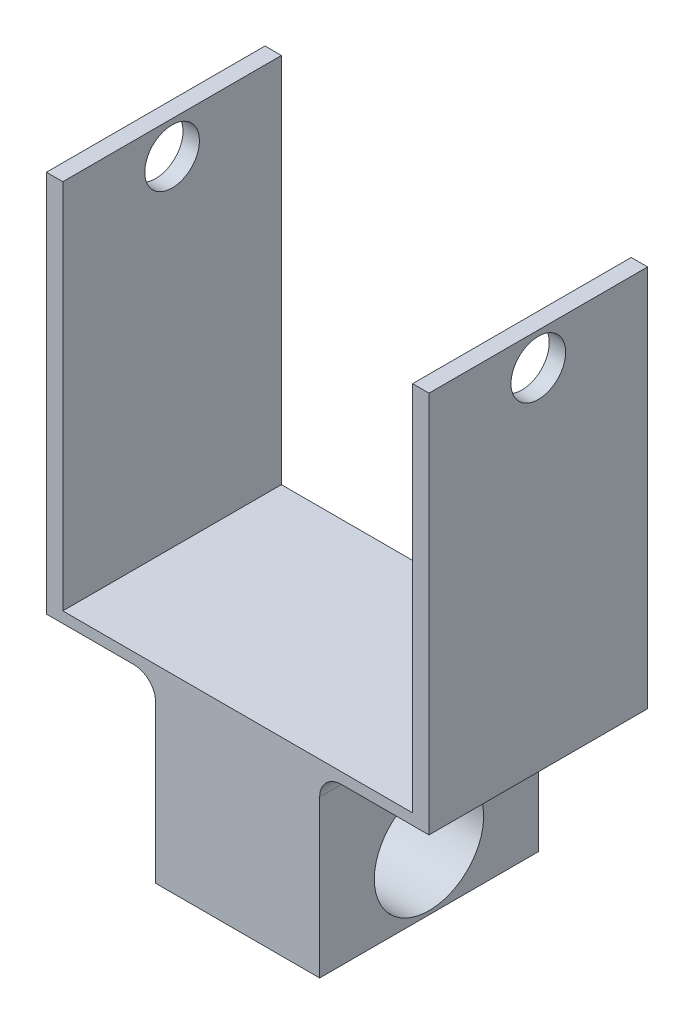
ISO-10303-21;
HEADER;
FILE_DESCRIPTION(('STEP AP214'),'2;1');
FILE_NAME('part.step','',(''),(''),'','','');
FILE_SCHEMA(('AUTOMOTIVE_DESIGN { 1 0 10303 214 1 1 1 1 }'));
ENDSEC;
DATA;
#1=APPLICATION_CONTEXT('core data for automotive mechanical design processes');
#2=APPLICATION_PROTOCOL_DEFINITION('international standard','automotive_design',2000,#1);
#3=PRODUCT_CONTEXT('',#1,'mechanical');
#4=PRODUCT('Part','Part','',(#3));
#5=PRODUCT_RELATED_PRODUCT_CATEGORY('part','',(#4));
#6=PRODUCT_DEFINITION_FORMATION('','',#4);
#7=PRODUCT_DEFINITION_CONTEXT('part definition',#1,'design');
#8=PRODUCT_DEFINITION('design','',#6,#7);
#9=PRODUCT_DEFINITION_SHAPE('','',#8);
#10=(LENGTH_UNIT() NAMED_UNIT(*) SI_UNIT(.MILLI.,.METRE.));
#11=(NAMED_UNIT(*) PLANE_ANGLE_UNIT() SI_UNIT($,.RADIAN.));
#12=(NAMED_UNIT(*) SI_UNIT($,.STERADIAN.) SOLID_ANGLE_UNIT());
#13=UNCERTAINTY_MEASURE_WITH_UNIT(LENGTH_MEASURE(1.E-05),#10,'distance_accuracy_value','');
#14=(GEOMETRIC_REPRESENTATION_CONTEXT(3) GLOBAL_UNCERTAINTY_ASSIGNED_CONTEXT((#13)) GLOBAL_UNIT_ASSIGNED_CONTEXT((#10,
#11,#12)) REPRESENTATION_CONTEXT('',''));
#15=CARTESIAN_POINT('',(0.,0.,0.));
#16=DIRECTION('',(0.,0.,1.));
#17=DIRECTION('',(1.,0.,0.));
#18=AXIS2_PLACEMENT_3D('',#15,#16,#17);
#19=CARTESIAN_POINT('',(-17.5,40.,0.));
#20=DIRECTION('',(0.,0.,-1.));
#21=DIRECTION('',(-1.,0.,0.));
#22=AXIS2_PLACEMENT_3D('',#19,#20,#21);
#23=PLANE('',#22);
#24=DIRECTION('',(1.,0.,0.));
#25=VECTOR('',#24,1.);
#26=CARTESIAN_POINT('',(-17.5,-11.3317768302769,0.));
#27=LINE('',#26,#25);
#28=CARTESIAN_POINT('',(-7.5,-11.3317768302769,0.));
#29=VERTEX_POINT('',#28);
#30=CARTESIAN_POINT('',(7.5,-11.3317768302769,0.));
#31=VERTEX_POINT('',#30);
#32=EDGE_CURVE('E47',#29,#31,#27,.T.);
#33=ORIENTED_EDGE('',*,*,#32,.T.);
#34=DIRECTION('',(0.,1.,0.));
#35=VECTOR('',#34,1.);
#36=CARTESIAN_POINT('',(7.5,-16.,0.));
#37=LINE('',#36,#35);
#38=CARTESIAN_POINT('',(7.5,3.,0.));
#39=VERTEX_POINT('',#38);
#40=EDGE_CURVE('E149',#31,#39,#37,.T.);
#41=ORIENTED_EDGE('',*,*,#40,.T.);
#42=CARTESIAN_POINT('',(9.5,3.,0.));
#43=DIRECTION('',(0.,0.,-1.));
#44=DIRECTION('',(-1.,0.,0.));
#45=AXIS2_PLACEMENT_3D('',#42,#43,#44);
#46=CIRCLE('',#45,2.);
#47=CARTESIAN_POINT('',(9.5,5.,0.));
#48=VERTEX_POINT('',#47);
#49=EDGE_CURVE('E41',#39,#48,#46,.T.);
#50=ORIENTED_EDGE('',*,*,#49,.T.);
#51=DIRECTION('',(1.,0.,0.));
#52=VECTOR('',#51,1.);
#53=CARTESIAN_POINT('',(17.5,5.,0.));
#54=LINE('',#53,#52);
#55=CARTESIAN_POINT('',(17.5,5.,0.));
#56=VERTEX_POINT('',#55);
#57=EDGE_CURVE('E204',#48,#56,#54,.T.);
#58=ORIENTED_EDGE('',*,*,#57,.T.);
#59=DIRECTION('',(0.,-1.,0.));
#60=VECTOR('',#59,1.);
#61=CARTESIAN_POINT('',(17.5,40.,0.));
#62=LINE('',#61,#60);
#63=CARTESIAN_POINT('',(17.5,40.,0.));
#64=VERTEX_POINT('',#63);
#65=EDGE_CURVE('E175',#64,#56,#62,.T.);
#66=ORIENTED_EDGE('',*,*,#65,.F.);
#67=DIRECTION('',(1.,0.,0.));
#68=VECTOR('',#67,1.);
#69=CARTESIAN_POINT('',(-17.5,40.,0.));
#70=LINE('',#69,#68);
#71=CARTESIAN_POINT('',(16.,40.,0.));
#72=VERTEX_POINT('',#71);
#73=EDGE_CURVE('E159',#72,#64,#70,.T.);
#74=ORIENTED_EDGE('',*,*,#73,.F.);
#75=DIRECTION('',(0.,1.,0.));
#76=VECTOR('',#75,1.);
#77=CARTESIAN_POINT('',(16.,40.,0.));
#78=LINE('',#77,#76);
#79=CARTESIAN_POINT('',(16.,6.00000000000001,0.));
#80=VERTEX_POINT('',#79);
#81=EDGE_CURVE('E244',#80,#72,#78,.T.);
#82=ORIENTED_EDGE('',*,*,#81,.F.);
#83=DIRECTION('',(1.,0.,0.));
#84=VECTOR('',#83,1.);
#85=CARTESIAN_POINT('',(-16.,6.,0.));
#86=LINE('',#85,#84);
#87=CARTESIAN_POINT('',(-16.,6.,0.));
#88=VERTEX_POINT('',#87);
#89=EDGE_CURVE('E253',#88,#80,#86,.T.);
#90=ORIENTED_EDGE('',*,*,#89,.F.);
#91=DIRECTION('',(0.,-1.,0.));
#92=VECTOR('',#91,1.);
#93=CARTESIAN_POINT('',(-16.,40.,0.));
#94=LINE('',#93,#92);
#95=CARTESIAN_POINT('',(-16.,40.,0.));
#96=VERTEX_POINT('',#95);
#97=EDGE_CURVE('E239',#96,#88,#94,.T.);
#98=ORIENTED_EDGE('',*,*,#97,.F.);
#99=CARTESIAN_POINT('',(-17.5,40.,0.));
#100=VERTEX_POINT('',#99);
#101=EDGE_CURVE('E160',#100,#96,#70,.T.);
#102=ORIENTED_EDGE('',*,*,#101,.F.);
#103=DIRECTION('',(0.,-1.,0.));
#104=VECTOR('',#103,1.);
#105=CARTESIAN_POINT('',(-17.5,40.,0.));
#106=LINE('',#105,#104);
#107=CARTESIAN_POINT('',(-17.5,5.,0.));
#108=VERTEX_POINT('',#107);
#109=EDGE_CURVE('E178',#100,#108,#106,.T.);
#110=ORIENTED_EDGE('',*,*,#109,.T.);
#111=DIRECTION('',(1.,0.,0.));
#112=VECTOR('',#111,1.);
#113=CARTESIAN_POINT('',(-17.5,5.,0.));
#114=LINE('',#113,#112);
#115=CARTESIAN_POINT('',(-9.5,5.,0.));
#116=VERTEX_POINT('',#115);
#117=EDGE_CURVE('E221',#108,#116,#114,.T.);
#118=ORIENTED_EDGE('',*,*,#117,.T.);
#119=CARTESIAN_POINT('',(-9.5,3.,0.));
#120=DIRECTION('',(0.,0.,-1.));
#121=DIRECTION('',(-1.,0.,0.));
#122=AXIS2_PLACEMENT_3D('',#119,#120,#121);
#123=CIRCLE('',#122,2.);
#124=CARTESIAN_POINT('',(-7.5,3.,0.));
#125=VERTEX_POINT('',#124);
#126=EDGE_CURVE('E196',#116,#125,#123,.T.);
#127=ORIENTED_EDGE('',*,*,#126,.T.);
#128=DIRECTION('',(0.,1.,0.));
#129=VECTOR('',#128,1.);
#130=CARTESIAN_POINT('',(-7.5,-16.,0.));
#131=LINE('',#130,#129);
#132=EDGE_CURVE('E147',#29,#125,#131,.T.);
#133=ORIENTED_EDGE('',*,*,#132,.F.);
#134=EDGE_LOOP('',(#33,#41,#50,#58,#66,#74,#82,#90,#98,#102,#110,#118,#127,#133));
#135=FACE_BOUND('',#134,.T.);
#136=ADVANCED_FACE('F33',(#135),#23,.F.);
#137=CARTESIAN_POINT('',(-17.5,40.,-20.));
#138=DIRECTION('',(0.,0.,1.));
#139=DIRECTION('',(1.,0.,0.));
#140=AXIS2_PLACEMENT_3D('',#137,#138,#139);
#141=PLANE('',#140);
#142=DIRECTION('',(1.,0.,0.));
#143=VECTOR('',#142,1.);
#144=CARTESIAN_POINT('',(-17.5,-11.3317768302769,-20.));
#145=LINE('',#144,#143);
#146=CARTESIAN_POINT('',(-7.5,-11.3317768302769,-20.));
#147=VERTEX_POINT('',#146);
#148=CARTESIAN_POINT('',(7.5,-11.3317768302769,-20.));
#149=VERTEX_POINT('',#148);
#150=EDGE_CURVE('E134',#147,#149,#145,.T.);
#151=ORIENTED_EDGE('',*,*,#150,.F.);
#152=DIRECTION('',(0.,1.,0.));
#153=VECTOR('',#152,1.);
#154=CARTESIAN_POINT('',(-7.5,-16.,-20.));
#155=LINE('',#154,#153);
#156=CARTESIAN_POINT('',(-7.5,3.,-20.));
#157=VERTEX_POINT('',#156);
#158=EDGE_CURVE('E140',#147,#157,#155,.T.);
#159=ORIENTED_EDGE('',*,*,#158,.T.);
#160=CARTESIAN_POINT('',(-9.5,3.,-20.));
#161=DIRECTION('',(0.,0.,1.));
#162=DIRECTION('',(1.,0.,0.));
#163=AXIS2_PLACEMENT_3D('',#160,#161,#162);
#164=CIRCLE('',#163,2.);
#165=CARTESIAN_POINT('',(-9.5,5.,-20.));
#166=VERTEX_POINT('',#165);
#167=EDGE_CURVE('E194',#157,#166,#164,.T.);
#168=ORIENTED_EDGE('',*,*,#167,.T.);
#169=DIRECTION('',(1.,0.,0.));
#170=VECTOR('',#169,1.);
#171=CARTESIAN_POINT('',(-17.5,5.,-20.));
#172=LINE('',#171,#170);
#173=CARTESIAN_POINT('',(-17.5,5.,-20.));
#174=VERTEX_POINT('',#173);
#175=EDGE_CURVE('E229',#174,#166,#172,.T.);
#176=ORIENTED_EDGE('',*,*,#175,.F.);
#177=DIRECTION('',(0.,-1.,0.));
#178=VECTOR('',#177,1.);
#179=CARTESIAN_POINT('',(-17.5,40.,-20.));
#180=LINE('',#179,#178);
#181=CARTESIAN_POINT('',(-17.5,40.,-20.));
#182=VERTEX_POINT('',#181);
#183=EDGE_CURVE('E169',#182,#174,#180,.T.);
#184=ORIENTED_EDGE('',*,*,#183,.F.);
#185=DIRECTION('',(-1.,0.,0.));
#186=VECTOR('',#185,1.);
#187=CARTESIAN_POINT('',(-17.5,40.,-20.));
#188=LINE('',#187,#186);
#189=CARTESIAN_POINT('',(-16.,40.,-20.));
#190=VERTEX_POINT('',#189);
#191=EDGE_CURVE('E165',#190,#182,#188,.T.);
#192=ORIENTED_EDGE('',*,*,#191,.F.);
#193=DIRECTION('',(0.,-1.,0.));
#194=VECTOR('',#193,1.);
#195=CARTESIAN_POINT('',(-16.,40.,-20.));
#196=LINE('',#195,#194);
#197=CARTESIAN_POINT('',(-16.,6.,-20.));
#198=VERTEX_POINT('',#197);
#199=EDGE_CURVE('E240',#190,#198,#196,.T.);
#200=ORIENTED_EDGE('',*,*,#199,.T.);
#201=DIRECTION('',(1.,0.,0.));
#202=VECTOR('',#201,1.);
#203=CARTESIAN_POINT('',(-16.,6.,-20.));
#204=LINE('',#203,#202);
#205=CARTESIAN_POINT('',(16.,6.00000000000001,-20.));
#206=VERTEX_POINT('',#205);
#207=EDGE_CURVE('E243',#198,#206,#204,.T.);
#208=ORIENTED_EDGE('',*,*,#207,.T.);
#209=DIRECTION('',(0.,1.,0.));
#210=VECTOR('',#209,1.);
#211=CARTESIAN_POINT('',(16.,40.,-20.));
#212=LINE('',#211,#210);
#213=CARTESIAN_POINT('',(16.,40.,-20.));
#214=VERTEX_POINT('',#213);
#215=EDGE_CURVE('E247',#206,#214,#212,.T.);
#216=ORIENTED_EDGE('',*,*,#215,.T.);
#217=CARTESIAN_POINT('',(17.5,40.,-20.));
#218=VERTEX_POINT('',#217);
#219=EDGE_CURVE('E166',#218,#214,#188,.T.);
#220=ORIENTED_EDGE('',*,*,#219,.F.);
#221=DIRECTION('',(0.,-1.,0.));
#222=VECTOR('',#221,1.);
#223=CARTESIAN_POINT('',(17.5,40.,-20.));
#224=LINE('',#223,#222);
#225=CARTESIAN_POINT('',(17.5,5.,-20.));
#226=VERTEX_POINT('',#225);
#227=EDGE_CURVE('E172',#218,#226,#224,.T.);
#228=ORIENTED_EDGE('',*,*,#227,.T.);
#229=DIRECTION('',(1.,0.,0.));
#230=VECTOR('',#229,1.);
#231=CARTESIAN_POINT('',(17.5,5.,-20.));
#232=LINE('',#231,#230);
#233=CARTESIAN_POINT('',(9.5,5.,-20.));
#234=VERTEX_POINT('',#233);
#235=EDGE_CURVE('E215',#234,#226,#232,.T.);
#236=ORIENTED_EDGE('',*,*,#235,.F.);
#237=CARTESIAN_POINT('',(9.5,3.,-20.));
#238=DIRECTION('',(0.,0.,1.));
#239=DIRECTION('',(1.,0.,0.));
#240=AXIS2_PLACEMENT_3D('',#237,#238,#239);
#241=CIRCLE('',#240,2.);
#242=CARTESIAN_POINT('',(7.5,3.,-20.));
#243=VERTEX_POINT('',#242);
#244=EDGE_CURVE('E199',#234,#243,#241,.T.);
#245=ORIENTED_EDGE('',*,*,#244,.T.);
#246=DIRECTION('',(0.,1.,0.));
#247=VECTOR('',#246,1.);
#248=CARTESIAN_POINT('',(7.5,-16.,-20.));
#249=LINE('',#248,#247);
#250=EDGE_CURVE('E55',#149,#243,#249,.T.);
#251=ORIENTED_EDGE('',*,*,#250,.F.);
#252=EDGE_LOOP('',(#151,#159,#168,#176,#184,#192,#200,#208,#216,#220,#228,#236,#245,#251));
#253=FACE_BOUND('',#252,.T.);
#254=ADVANCED_FACE('F139',(#253),#141,.F.);
#255=CARTESIAN_POINT('',(7.5,-16.,-20.));
#256=DIRECTION('',(-1.,0.,0.));
#257=DIRECTION('',(0.,0.,1.));
#258=AXIS2_PLACEMENT_3D('',#255,#256,#257);
#259=PLANE('',#258);
#260=CARTESIAN_POINT('',(7.5,-6.,-10.));
#261=DIRECTION('',(-1.,0.,0.));
#262=DIRECTION('',(0.,0.,1.));
#263=AXIS2_PLACEMENT_3D('',#260,#261,#262);
#264=CIRCLE('',#263,5.);
#265=CARTESIAN_POINT('',(7.5,-6.,-5.));
#266=VERTEX_POINT('',#265);
#267=EDGE_CURVE('E151',#266,#266,#264,.T.);
#268=ORIENTED_EDGE('',*,*,#267,.T.);
#269=EDGE_LOOP('',(#268));
#270=FACE_BOUND('',#269,.T.);
#271=DIRECTION('',(0.,0.,1.));
#272=VECTOR('',#271,1.);
#273=CARTESIAN_POINT('',(7.5,-11.3317768302769,-20.));
#274=LINE('',#273,#272);
#275=EDGE_CURVE('E231',#149,#31,#274,.T.);
#276=ORIENTED_EDGE('',*,*,#275,.F.);
#277=ORIENTED_EDGE('',*,*,#250,.T.);
#278=DIRECTION('',(0.,0.,-1.));
#279=VECTOR('',#278,1.);
#280=CARTESIAN_POINT('',(7.5,3.,0.));
#281=LINE('',#280,#279);
#282=EDGE_CURVE('E192',#243,#39,#281,.F.);
#283=ORIENTED_EDGE('',*,*,#282,.T.);
#284=ORIENTED_EDGE('',*,*,#40,.F.);
#285=EDGE_LOOP('',(#276,#277,#283,#284));
#286=FACE_BOUND('',#285,.T.);
#287=ADVANCED_FACE('F270',(#270,#286),#259,.F.);
#288=CARTESIAN_POINT('',(-7.5,-16.,-20.));
#289=DIRECTION('',(1.,0.,0.));
#290=DIRECTION('',(0.,0.,-1.));
#291=AXIS2_PLACEMENT_3D('',#288,#289,#290);
#292=PLANE('',#291);
#293=CARTESIAN_POINT('',(-7.5,-6.,-10.));
#294=DIRECTION('',(-1.,0.,0.));
#295=DIRECTION('',(0.,0.,1.));
#296=AXIS2_PLACEMENT_3D('',#293,#294,#295);
#297=CIRCLE('',#296,5.);
#298=CARTESIAN_POINT('',(-7.5,-6.,-5.));
#299=VERTEX_POINT('',#298);
#300=EDGE_CURVE('E259',#299,#299,#297,.T.);
#301=ORIENTED_EDGE('',*,*,#300,.F.);
#302=EDGE_LOOP('',(#301));
#303=FACE_BOUND('',#302,.T.);
#304=DIRECTION('',(0.,0.,-1.));
#305=VECTOR('',#304,1.);
#306=CARTESIAN_POINT('',(-7.5,-11.3317768302769,-20.));
#307=LINE('',#306,#305);
#308=EDGE_CURVE('E11',#29,#147,#307,.T.);
#309=ORIENTED_EDGE('',*,*,#308,.F.);
#310=ORIENTED_EDGE('',*,*,#132,.T.);
#311=DIRECTION('',(0.,0.,-1.));
#312=VECTOR('',#311,1.);
#313=CARTESIAN_POINT('',(-7.5,3.,-20.));
#314=LINE('',#313,#312);
#315=EDGE_CURVE('E146',#125,#157,#314,.T.);
#316=ORIENTED_EDGE('',*,*,#315,.T.);
#317=ORIENTED_EDGE('',*,*,#158,.F.);
#318=EDGE_LOOP('',(#309,#310,#316,#317));
#319=FACE_BOUND('',#318,.T.);
#320=ADVANCED_FACE('F144',(#303,#319),#292,.F.);
#321=CARTESIAN_POINT('',(0.,40.,0.));
#322=DIRECTION('',(0.,-1.,0.));
#323=DIRECTION('',(0.,0.,-1.));
#324=AXIS2_PLACEMENT_3D('',#321,#322,#323);
#325=PLANE('',#324);
#326=ORIENTED_EDGE('',*,*,#101,.T.);
#327=DIRECTION('',(0.,0.,1.));
#328=VECTOR('',#327,1.);
#329=CARTESIAN_POINT('',(-16.,40.,-20.));
#330=LINE('',#329,#328);
#331=EDGE_CURVE('E257',#190,#96,#330,.T.);
#332=ORIENTED_EDGE('',*,*,#331,.F.);
#333=ORIENTED_EDGE('',*,*,#191,.T.);
#334=DIRECTION('',(0.,0.,1.));
#335=VECTOR('',#334,1.);
#336=CARTESIAN_POINT('',(-17.5,40.,0.));
#337=LINE('',#336,#335);
#338=EDGE_CURVE('E156',#182,#100,#337,.T.);
#339=ORIENTED_EDGE('',*,*,#338,.T.);
#340=EDGE_LOOP('',(#326,#332,#333,#339));
#341=FACE_BOUND('',#340,.T.);
#342=ADVANCED_FACE('F288',(#341),#325,.F.);
#343=CARTESIAN_POINT('',(-17.5,40.,0.));
#344=DIRECTION('',(1.,0.,0.));
#345=DIRECTION('',(0.,0.,-1.));
#346=AXIS2_PLACEMENT_3D('',#343,#344,#345);
#347=PLANE('',#346);
#348=CARTESIAN_POINT('',(-17.5,37.,-10.));
#349=DIRECTION('',(-1.,0.,0.));
#350=DIRECTION('',(0.,0.,1.));
#351=AXIS2_PLACEMENT_3D('',#348,#349,#350);
#352=CIRCLE('',#351,2.5);
#353=CARTESIAN_POINT('',(-17.5,37.,-7.5));
#354=VERTEX_POINT('',#353);
#355=EDGE_CURVE('E226',#354,#354,#352,.T.);
#356=ORIENTED_EDGE('',*,*,#355,.F.);
#357=EDGE_LOOP('',(#356));
#358=FACE_BOUND('',#357,.T.);
#359=ORIENTED_EDGE('',*,*,#183,.T.);
#360=DIRECTION('',(0.,0.,-1.));
#361=VECTOR('',#360,1.);
#362=CARTESIAN_POINT('',(-17.5,5.,0.));
#363=LINE('',#362,#361);
#364=EDGE_CURVE('E219',#108,#174,#363,.T.);
#365=ORIENTED_EDGE('',*,*,#364,.F.);
#366=ORIENTED_EDGE('',*,*,#109,.F.);
#367=ORIENTED_EDGE('',*,*,#338,.F.);
#368=EDGE_LOOP('',(#359,#365,#366,#367));
#369=FACE_BOUND('',#368,.T.);
#370=ADVANCED_FACE('F298',(#358,#369),#347,.F.);
#371=CARTESIAN_POINT('',(17.5,40.,0.));
#372=DIRECTION('',(-1.,0.,0.));
#373=DIRECTION('',(0.,0.,1.));
#374=AXIS2_PLACEMENT_3D('',#371,#372,#373);
#375=PLANE('',#374);
#376=CARTESIAN_POINT('',(17.5,37.,-10.));
#377=DIRECTION('',(-1.,0.,0.));
#378=DIRECTION('',(0.,0.,1.));
#379=AXIS2_PLACEMENT_3D('',#376,#377,#378);
#380=CIRCLE('',#379,2.5);
#381=CARTESIAN_POINT('',(17.5,37.,-7.5));
#382=VERTEX_POINT('',#381);
#383=EDGE_CURVE('E185',#382,#382,#380,.T.);
#384=ORIENTED_EDGE('',*,*,#383,.T.);
#385=EDGE_LOOP('',(#384));
#386=FACE_BOUND('',#385,.T.);
#387=ORIENTED_EDGE('',*,*,#65,.T.);
#388=DIRECTION('',(0.,0.,-1.));
#389=VECTOR('',#388,1.);
#390=CARTESIAN_POINT('',(17.5,5.,0.));
#391=LINE('',#390,#389);
#392=EDGE_CURVE('E214',#56,#226,#391,.T.);
#393=ORIENTED_EDGE('',*,*,#392,.T.);
#394=ORIENTED_EDGE('',*,*,#227,.F.);
#395=DIRECTION('',(0.,0.,-1.));
#396=VECTOR('',#395,1.);
#397=CARTESIAN_POINT('',(17.5,40.,0.));
#398=LINE('',#397,#396);
#399=EDGE_CURVE('E163',#64,#218,#398,.T.);
#400=ORIENTED_EDGE('',*,*,#399,.F.);
#401=EDGE_LOOP('',(#387,#393,#394,#400));
#402=FACE_BOUND('',#401,.T.);
#403=ADVANCED_FACE('F285',(#386,#402),#375,.F.);
#404=ORIENTED_EDGE('',*,*,#219,.T.);
#405=DIRECTION('',(0.,0.,1.));
#406=VECTOR('',#405,1.);
#407=CARTESIAN_POINT('',(16.,40.,-20.));
#408=LINE('',#407,#406);
#409=EDGE_CURVE('E260',#214,#72,#408,.T.);
#410=ORIENTED_EDGE('',*,*,#409,.T.);
#411=ORIENTED_EDGE('',*,*,#73,.T.);
#412=ORIENTED_EDGE('',*,*,#399,.T.);
#413=EDGE_LOOP('',(#404,#410,#411,#412));
#414=FACE_BOUND('',#413,.T.);
#415=ADVANCED_FACE('F275',(#414),#325,.F.);
#416=CARTESIAN_POINT('',(17.5,-6.,-10.));
#417=DIRECTION('',(-1.,0.,0.));
#418=DIRECTION('',(0.,0.,1.));
#419=AXIS2_PLACEMENT_3D('',#416,#417,#418);
#420=CYLINDRICAL_SURFACE('',#419,5.);
#421=ORIENTED_EDGE('',*,*,#300,.T.);
#422=EDGE_LOOP('',(#421));
#423=FACE_BOUND('',#422,.T.);
#424=ORIENTED_EDGE('',*,*,#267,.F.);
#425=EDGE_LOOP('',(#424));
#426=FACE_BOUND('',#425,.T.);
#427=ADVANCED_FACE('F272',(#423,#426),#420,.F.);
#428=CARTESIAN_POINT('',(-16.,40.,-20.));
#429=DIRECTION('',(-1.,0.,0.));
#430=DIRECTION('',(0.,-1.,0.));
#431=AXIS2_PLACEMENT_3D('',#428,#429,#430);
#432=PLANE('',#431);
#433=CARTESIAN_POINT('',(-16.,37.,-10.));
#434=DIRECTION('',(-1.,0.,0.));
#435=DIRECTION('',(0.,-1.,0.));
#436=AXIS2_PLACEMENT_3D('',#433,#434,#435);
#437=CIRCLE('',#436,2.5);
#438=CARTESIAN_POINT('',(-16.,34.5,-10.));
#439=VERTEX_POINT('',#438);
#440=EDGE_CURVE('E184',#439,#439,#437,.T.);
#441=ORIENTED_EDGE('',*,*,#440,.T.);
#442=EDGE_LOOP('',(#441));
#443=FACE_BOUND('',#442,.T.);
#444=ORIENTED_EDGE('',*,*,#97,.T.);
#445=DIRECTION('',(0.,0.,1.));
#446=VECTOR('',#445,1.);
#447=CARTESIAN_POINT('',(-16.,6.,-20.));
#448=LINE('',#447,#446);
#449=EDGE_CURVE('E250',#198,#88,#448,.T.);
#450=ORIENTED_EDGE('',*,*,#449,.F.);
#451=ORIENTED_EDGE('',*,*,#199,.F.);
#452=ORIENTED_EDGE('',*,*,#331,.T.);
#453=EDGE_LOOP('',(#444,#450,#451,#452));
#454=FACE_BOUND('',#453,.T.);
#455=ADVANCED_FACE('F274',(#443,#454),#432,.F.);
#456=CARTESIAN_POINT('',(16.,40.,-20.));
#457=DIRECTION('',(1.,0.,0.));
#458=DIRECTION('',(0.,1.,0.));
#459=AXIS2_PLACEMENT_3D('',#456,#457,#458);
#460=PLANE('',#459);
#461=CARTESIAN_POINT('',(16.,37.,-10.));
#462=DIRECTION('',(1.,0.,0.));
#463=DIRECTION('',(0.,1.,0.));
#464=AXIS2_PLACEMENT_3D('',#461,#462,#463);
#465=CIRCLE('',#464,2.5);
#466=CARTESIAN_POINT('',(16.,39.5,-10.));
#467=VERTEX_POINT('',#466);
#468=EDGE_CURVE('E181',#467,#467,#465,.T.);
#469=ORIENTED_EDGE('',*,*,#468,.T.);
#470=EDGE_LOOP('',(#469));
#471=FACE_BOUND('',#470,.T.);
#472=ORIENTED_EDGE('',*,*,#81,.T.);
#473=ORIENTED_EDGE('',*,*,#409,.F.);
#474=ORIENTED_EDGE('',*,*,#215,.F.);
#475=DIRECTION('',(0.,0.,1.));
#476=VECTOR('',#475,1.);
#477=CARTESIAN_POINT('',(16.,6.00000000000001,-20.));
#478=LINE('',#477,#476);
#479=EDGE_CURVE('E263',#206,#80,#478,.T.);
#480=ORIENTED_EDGE('',*,*,#479,.T.);
#481=EDGE_LOOP('',(#472,#473,#474,#480));
#482=FACE_BOUND('',#481,.T.);
#483=ADVANCED_FACE('F282',(#471,#482),#460,.F.);
#484=CARTESIAN_POINT('',(-16.,6.,-20.));
#485=DIRECTION('',(0.,-1.,0.));
#486=DIRECTION('',(1.,0.,0.));
#487=AXIS2_PLACEMENT_3D('',#484,#485,#486);
#488=PLANE('',#487);
#489=ORIENTED_EDGE('',*,*,#89,.T.);
#490=ORIENTED_EDGE('',*,*,#479,.F.);
#491=ORIENTED_EDGE('',*,*,#207,.F.);
#492=ORIENTED_EDGE('',*,*,#449,.T.);
#493=EDGE_LOOP('',(#489,#490,#491,#492));
#494=FACE_BOUND('',#493,.T.);
#495=ADVANCED_FACE('F328',(#494),#488,.F.);
#496=CARTESIAN_POINT('',(17.5,37.,-10.));
#497=DIRECTION('',(-1.,0.,0.));
#498=DIRECTION('',(0.,0.,1.));
#499=AXIS2_PLACEMENT_3D('',#496,#497,#498);
#500=CYLINDRICAL_SURFACE('',#499,2.5);
#501=ORIENTED_EDGE('',*,*,#383,.F.);
#502=EDGE_LOOP('',(#501));
#503=FACE_BOUND('',#502,.T.);
#504=ORIENTED_EDGE('',*,*,#468,.F.);
#505=EDGE_LOOP('',(#504));
#506=FACE_BOUND('',#505,.T.);
#507=ADVANCED_FACE('F340',(#503,#506),#500,.F.);
#508=ORIENTED_EDGE('',*,*,#355,.T.);
#509=EDGE_LOOP('',(#508));
#510=FACE_BOUND('',#509,.T.);
#511=ORIENTED_EDGE('',*,*,#440,.F.);
#512=EDGE_LOOP('',(#511));
#513=FACE_BOUND('',#512,.T.);
#514=ADVANCED_FACE('F343',(#510,#513),#500,.F.);
#515=CARTESIAN_POINT('',(-17.5,5.,0.));
#516=DIRECTION('',(0.,1.,0.));
#517=DIRECTION('',(0.,0.,1.));
#518=AXIS2_PLACEMENT_3D('',#515,#516,#517);
#519=PLANE('',#518);
#520=ORIENTED_EDGE('',*,*,#175,.T.);
#521=DIRECTION('',(0.,0.,-1.));
#522=VECTOR('',#521,1.);
#523=CARTESIAN_POINT('',(-9.5,5.,0.));
#524=LINE('',#523,#522);
#525=EDGE_CURVE('E187',#166,#116,#524,.F.);
#526=ORIENTED_EDGE('',*,*,#525,.T.);
#527=ORIENTED_EDGE('',*,*,#117,.F.);
#528=ORIENTED_EDGE('',*,*,#364,.T.);
#529=EDGE_LOOP('',(#520,#526,#527,#528));
#530=FACE_BOUND('',#529,.T.);
#531=ADVANCED_FACE('F308',(#530),#519,.F.);
#532=CARTESIAN_POINT('',(17.5,5.,0.));
#533=DIRECTION('',(0.,1.,0.));
#534=DIRECTION('',(0.,0.,1.));
#535=AXIS2_PLACEMENT_3D('',#532,#533,#534);
#536=PLANE('',#535);
#537=ORIENTED_EDGE('',*,*,#57,.F.);
#538=DIRECTION('',(0.,0.,-1.));
#539=VECTOR('',#538,1.);
#540=CARTESIAN_POINT('',(9.5,5.,-20.));
#541=LINE('',#540,#539);
#542=EDGE_CURVE('E189',#48,#234,#541,.T.);
#543=ORIENTED_EDGE('',*,*,#542,.T.);
#544=ORIENTED_EDGE('',*,*,#235,.T.);
#545=ORIENTED_EDGE('',*,*,#392,.F.);
#546=EDGE_LOOP('',(#537,#543,#544,#545));
#547=FACE_BOUND('',#546,.T.);
#548=ADVANCED_FACE('F211',(#547),#536,.F.);
#549=CARTESIAN_POINT('',(-9.5,3.,-20.));
#550=DIRECTION('',(0.,0.,1.));
#551=DIRECTION('',(1.,0.,0.));
#552=AXIS2_PLACEMENT_3D('',#549,#550,#551);
#553=CYLINDRICAL_SURFACE('',#552,2.);
#554=ORIENTED_EDGE('',*,*,#126,.F.);
#555=ORIENTED_EDGE('',*,*,#525,.F.);
#556=ORIENTED_EDGE('',*,*,#167,.F.);
#557=ORIENTED_EDGE('',*,*,#315,.F.);
#558=EDGE_LOOP('',(#554,#555,#556,#557));
#559=FACE_BOUND('',#558,.T.);
#560=ADVANCED_FACE('F301',(#559),#553,.F.);
#561=CARTESIAN_POINT('',(9.5,3.,0.));
#562=DIRECTION('',(0.,0.,1.));
#563=DIRECTION('',(1.,0.,0.));
#564=AXIS2_PLACEMENT_3D('',#561,#562,#563);
#565=CYLINDRICAL_SURFACE('',#564,2.);
#566=ORIENTED_EDGE('',*,*,#49,.F.);
#567=ORIENTED_EDGE('',*,*,#282,.F.);
#568=ORIENTED_EDGE('',*,*,#244,.F.);
#569=ORIENTED_EDGE('',*,*,#542,.F.);
#570=EDGE_LOOP('',(#566,#567,#568,#569));
#571=FACE_BOUND('',#570,.T.);
#572=ADVANCED_FACE('F35',(#571),#565,.F.);
#573=CARTESIAN_POINT('',(-17.5,-11.3317768302769,0.));
#574=DIRECTION('',(0.,-1.,0.));
#575=DIRECTION('',(0.,0.,-1.));
#576=AXIS2_PLACEMENT_3D('',#573,#574,#575);
#577=PLANE('',#576);
#578=ORIENTED_EDGE('',*,*,#275,.T.);
#579=ORIENTED_EDGE('',*,*,#32,.F.);
#580=ORIENTED_EDGE('',*,*,#308,.T.);
#581=ORIENTED_EDGE('',*,*,#150,.T.);
#582=EDGE_LOOP('',(#578,#579,#580,#581));
#583=FACE_BOUND('',#582,.T.);
#584=ADVANCED_FACE('F133',(#583),#577,.T.);
#585=CLOSED_SHELL('',(#136,#254,#287,#320,#342,#370,#403,#415,#427,#455,#483,#495,#507,#514,
#531,#548,#560,#572,#584));
#586=MANIFOLD_SOLID_BREP('B2',#585);
#587=ADVANCED_BREP_SHAPE_REPRESENTATION('',(#18,#586),#14);
#588=SHAPE_DEFINITION_REPRESENTATION(#9,#587);
ENDSEC;
END-ISO-10303-21;
